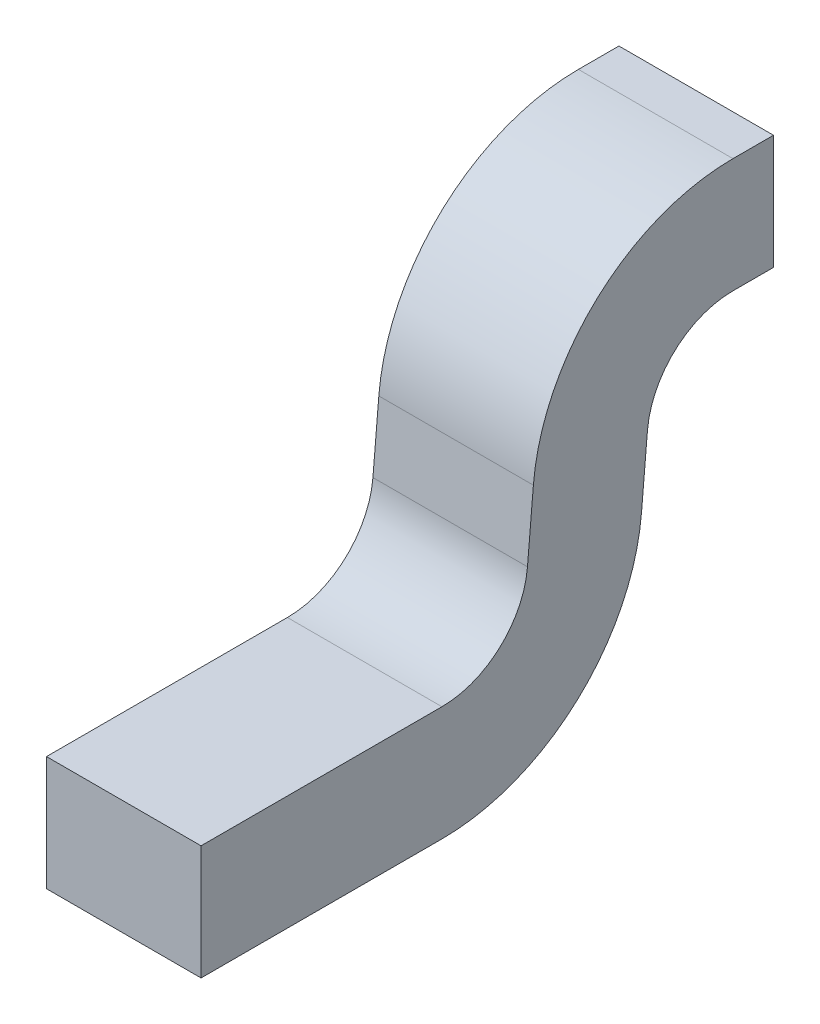
ISO-10303-21;
HEADER;
FILE_DESCRIPTION(('STEP AP214'),'2;1');
FILE_NAME('part.step','',(''),(''),'','','');
FILE_SCHEMA(('AUTOMOTIVE_DESIGN { 1 0 10303 214 1 1 1 1 }'));
ENDSEC;
DATA;
#1=APPLICATION_CONTEXT('core data for automotive mechanical design processes');
#2=APPLICATION_PROTOCOL_DEFINITION('international standard','automotive_design',2000,#1);
#3=PRODUCT_CONTEXT('',#1,'mechanical');
#4=PRODUCT('Part','Part','',(#3));
#5=PRODUCT_RELATED_PRODUCT_CATEGORY('part','',(#4));
#6=PRODUCT_DEFINITION_FORMATION('','',#4);
#7=PRODUCT_DEFINITION_CONTEXT('part definition',#1,'design');
#8=PRODUCT_DEFINITION('design','',#6,#7);
#9=PRODUCT_DEFINITION_SHAPE('','',#8);
#10=(LENGTH_UNIT() NAMED_UNIT(*) SI_UNIT(.MILLI.,.METRE.));
#11=(NAMED_UNIT(*) PLANE_ANGLE_UNIT() SI_UNIT($,.RADIAN.));
#12=(NAMED_UNIT(*) SI_UNIT($,.STERADIAN.) SOLID_ANGLE_UNIT());
#13=UNCERTAINTY_MEASURE_WITH_UNIT(LENGTH_MEASURE(1.E-05),#10,'distance_accuracy_value','');
#14=(GEOMETRIC_REPRESENTATION_CONTEXT(3) GLOBAL_UNCERTAINTY_ASSIGNED_CONTEXT((#13)) GLOBAL_UNIT_ASSIGNED_CONTEXT((#10,
#11,#12)) REPRESENTATION_CONTEXT('',''));
#15=CARTESIAN_POINT('',(0.,0.,0.));
#16=DIRECTION('',(0.,0.,1.));
#17=DIRECTION('',(1.,0.,0.));
#18=AXIS2_PLACEMENT_3D('',#15,#16,#17);
#19=CARTESIAN_POINT('',(-0.135,0.1,0.0707957308561916));
#20=DIRECTION('',(1.,0.,0.));
#21=DIRECTION('',(0.,1.,0.));
#22=AXIS2_PLACEMENT_3D('',#19,#20,#21);
#23=PLANE('',#22);
#24=CARTESIAN_POINT('',(-0.135,-0.25,0.0707957308561916));
#25=DIRECTION('',(1.,0.,0.));
#26=DIRECTION('',(0.,0.,-1.));
#27=AXIS2_PLACEMENT_3D('',#24,#25,#26);
#28=CIRCLE('',#27,0.15);
#29=CARTESIAN_POINT('',(-0.135,-0.1,0.0707957308561916));
#30=VERTEX_POINT('',#29);
#31=CARTESIAN_POINT('',(-0.135,-0.237005557545274,0.220231819085544));
#32=VERTEX_POINT('',#31);
#33=EDGE_CURVE('E19',#30,#32,#28,.T.);
#34=ORIENTED_EDGE('',*,*,#33,.T.);
#35=DIRECTION('',(0.,0.996240588195683,-0.0866296163648428));
#36=VECTOR('',#35,1.);
#37=CARTESIAN_POINT('',(-0.135,-0.237005557545274,0.220231819085544));
#38=LINE('',#37,#36);
#39=CARTESIAN_POINT('',(-0.135,-0.355320365727695,0.23052006327532));
#40=VERTEX_POINT('',#39);
#41=EDGE_CURVE('E149',#40,#32,#38,.T.);
#42=ORIENTED_EDGE('',*,*,#41,.F.);
#43=CARTESIAN_POINT('',(-0.135,-0.325,0.579204269143809));
#44=DIRECTION('',(-1.,0.,0.));
#45=DIRECTION('',(0.,0.,1.));
#46=AXIS2_PLACEMENT_3D('',#43,#44,#45);
#47=CIRCLE('',#46,0.35);
#48=CARTESIAN_POINT('',(-0.135,-0.675,0.579204269143809));
#49=VERTEX_POINT('',#48);
#50=EDGE_CURVE('E173',#49,#40,#47,.F.);
#51=ORIENTED_EDGE('',*,*,#50,.F.);
#52=DIRECTION('',(0.,0.,-1.));
#53=VECTOR('',#52,1.);
#54=CARTESIAN_POINT('',(-0.135,-0.675,0.579204269143809));
#55=LINE('',#54,#53);
#56=CARTESIAN_POINT('',(-0.135,-0.675,1.));
#57=VERTEX_POINT('',#56);
#58=EDGE_CURVE('E144',#57,#49,#55,.T.);
#59=ORIENTED_EDGE('',*,*,#58,.F.);
#60=DIRECTION('',(0.,-1.,0.));
#61=VECTOR('',#60,1.);
#62=CARTESIAN_POINT('',(-0.135,-0.675,1.));
#63=LINE('',#62,#61);
#64=CARTESIAN_POINT('',(-0.135,-0.475,1.));
#65=VERTEX_POINT('',#64);
#66=EDGE_CURVE('E137',#65,#57,#63,.T.);
#67=ORIENTED_EDGE('',*,*,#66,.F.);
#68=DIRECTION('',(0.,0.,1.));
#69=VECTOR('',#68,1.);
#70=CARTESIAN_POINT('',(-0.135,-0.475,0.579204269143809));
#71=LINE('',#70,#69);
#72=CARTESIAN_POINT('',(-0.135,-0.475,0.579204269143809));
#73=VERTEX_POINT('',#72);
#74=EDGE_CURVE('E130',#73,#65,#71,.T.);
#75=ORIENTED_EDGE('',*,*,#74,.F.);
#76=CARTESIAN_POINT('',(-0.135,-0.325,0.579204269143809));
#77=DIRECTION('',(-1.,0.,0.));
#78=DIRECTION('',(0.,0.,1.));
#79=AXIS2_PLACEMENT_3D('',#76,#77,#78);
#80=CIRCLE('',#79,0.15);
#81=CARTESIAN_POINT('',(-0.135,-0.337994442454726,0.429768180914457));
#82=VERTEX_POINT('',#81);
#83=EDGE_CURVE('E172',#73,#82,#80,.F.);
#84=ORIENTED_EDGE('',*,*,#83,.T.);
#85=DIRECTION('',(0.,-0.996240588195683,0.0866296163648428));
#86=VECTOR('',#85,1.);
#87=CARTESIAN_POINT('',(-0.135,-0.219679634272305,0.419479936724681));
#88=LINE('',#87,#86);
#89=CARTESIAN_POINT('',(-0.135,-0.219679634272305,0.419479936724681));
#90=VERTEX_POINT('',#89);
#91=EDGE_CURVE('E125',#90,#82,#88,.T.);
#92=ORIENTED_EDGE('',*,*,#91,.F.);
#93=CARTESIAN_POINT('',(-0.135,-0.25,0.0707957308561916));
#94=DIRECTION('',(1.,0.,0.));
#95=DIRECTION('',(0.,0.,-1.));
#96=AXIS2_PLACEMENT_3D('',#93,#94,#95);
#97=CIRCLE('',#96,0.35);
#98=CARTESIAN_POINT('',(-0.135,0.1,0.0707957308561916));
#99=VERTEX_POINT('',#98);
#100=EDGE_CURVE('E109',#99,#90,#97,.T.);
#101=ORIENTED_EDGE('',*,*,#100,.F.);
#102=DIRECTION('',(0.,0.,-1.));
#103=VECTOR('',#102,1.);
#104=CARTESIAN_POINT('',(-0.135,0.1,0.0707957308561916));
#105=LINE('',#104,#103);
#106=CARTESIAN_POINT('',(-0.135,0.1,0.));
#107=VERTEX_POINT('',#106);
#108=EDGE_CURVE('E108',#99,#107,#105,.T.);
#109=ORIENTED_EDGE('',*,*,#108,.T.);
#110=DIRECTION('',(0.,1.,0.));
#111=VECTOR('',#110,1.);
#112=CARTESIAN_POINT('',(-0.135,-0.1,0.));
#113=LINE('',#112,#111);
#114=CARTESIAN_POINT('',(-0.135,-0.1,0.));
#115=VERTEX_POINT('',#114);
#116=EDGE_CURVE('E94',#107,#115,#113,.F.);
#117=ORIENTED_EDGE('',*,*,#116,.T.);
#118=DIRECTION('',(0.,0.,1.));
#119=VECTOR('',#118,1.);
#120=CARTESIAN_POINT('',(-0.135,-0.1,0.0707957308561916));
#121=LINE('',#120,#119);
#122=EDGE_CURVE('E88',#115,#30,#121,.T.);
#123=ORIENTED_EDGE('',*,*,#122,.T.);
#124=EDGE_LOOP('',(#34,#42,#51,#59,#67,#75,#84,#92,#101,#109,#117,#123));
#125=FACE_BOUND('',#124,.T.);
#126=ADVANCED_FACE('F16',(#125),#23,.F.);
#127=CARTESIAN_POINT('',(0.135,-0.1,0.));
#128=DIRECTION('',(0.,0.,1.));
#129=DIRECTION('',(1.,0.,0.));
#130=AXIS2_PLACEMENT_3D('',#127,#128,#129);
#131=PLANE('',#130);
#132=ORIENTED_EDGE('',*,*,#116,.F.);
#133=DIRECTION('',(1.,0.,0.));
#134=VECTOR('',#133,1.);
#135=CARTESIAN_POINT('',(-0.135,0.1,0.));
#136=LINE('',#135,#134);
#137=CARTESIAN_POINT('',(0.135,0.1,0.));
#138=VERTEX_POINT('',#137);
#139=EDGE_CURVE('E103',#107,#138,#136,.T.);
#140=ORIENTED_EDGE('',*,*,#139,.T.);
#141=DIRECTION('',(0.,1.,0.));
#142=VECTOR('',#141,1.);
#143=CARTESIAN_POINT('',(0.135,0.1,0.));
#144=LINE('',#143,#142);
#145=CARTESIAN_POINT('',(0.135,-0.1,0.));
#146=VERTEX_POINT('',#145);
#147=EDGE_CURVE('E112',#138,#146,#144,.F.);
#148=ORIENTED_EDGE('',*,*,#147,.T.);
#149=DIRECTION('',(1.,0.,0.));
#150=VECTOR('',#149,1.);
#151=CARTESIAN_POINT('',(-0.135,-0.1,0.));
#152=LINE('',#151,#150);
#153=EDGE_CURVE('E105',#146,#115,#152,.F.);
#154=ORIENTED_EDGE('',*,*,#153,.T.);
#155=EDGE_LOOP('',(#132,#140,#148,#154));
#156=FACE_BOUND('',#155,.T.);
#157=ADVANCED_FACE('F101',(#156),#131,.F.);
#158=CARTESIAN_POINT('',(-0.135,-0.1,0.0707957308561916));
#159=DIRECTION('',(0.,1.,0.));
#160=DIRECTION('',(0.,0.,1.));
#161=AXIS2_PLACEMENT_3D('',#158,#159,#160);
#162=PLANE('',#161);
#163=DIRECTION('',(1.,0.,0.));
#164=VECTOR('',#163,1.);
#165=CARTESIAN_POINT('',(0.,-0.1,0.0707957308561916));
#166=LINE('',#165,#164);
#167=CARTESIAN_POINT('',(0.135,-0.1,0.0707957308561916));
#168=VERTEX_POINT('',#167);
#169=EDGE_CURVE('E153',#168,#30,#166,.F.);
#170=ORIENTED_EDGE('',*,*,#169,.T.);
#171=ORIENTED_EDGE('',*,*,#122,.F.);
#172=ORIENTED_EDGE('',*,*,#153,.F.);
#173=DIRECTION('',(0.,0.,1.));
#174=VECTOR('',#173,1.);
#175=CARTESIAN_POINT('',(0.135,-0.1,0.0707957308561916));
#176=LINE('',#175,#174);
#177=EDGE_CURVE('E114',#146,#168,#176,.T.);
#178=ORIENTED_EDGE('',*,*,#177,.T.);
#179=EDGE_LOOP('',(#170,#171,#172,#178));
#180=FACE_BOUND('',#179,.T.);
#181=ADVANCED_FACE('F199',(#180),#162,.F.);
#182=CARTESIAN_POINT('',(0.,-0.25,0.0707957308561916));
#183=DIRECTION('',(1.,0.,0.));
#184=DIRECTION('',(0.,0.,-1.));
#185=AXIS2_PLACEMENT_3D('',#182,#183,#184);
#186=CYLINDRICAL_SURFACE('',#185,0.15);
#187=DIRECTION('',(1.,0.,0.));
#188=VECTOR('',#187,1.);
#189=CARTESIAN_POINT('',(-0.135,-0.237005557545274,0.220231819085544));
#190=LINE('',#189,#188);
#191=CARTESIAN_POINT('',(0.135,-0.237005557545274,0.220231819085544));
#192=VERTEX_POINT('',#191);
#193=EDGE_CURVE('E151',#32,#192,#190,.T.);
#194=ORIENTED_EDGE('',*,*,#193,.F.);
#195=ORIENTED_EDGE('',*,*,#33,.F.);
#196=ORIENTED_EDGE('',*,*,#169,.F.);
#197=CARTESIAN_POINT('',(0.135,-0.25,0.0707957308561916));
#198=DIRECTION('',(1.,0.,0.));
#199=DIRECTION('',(0.,0.,-1.));
#200=AXIS2_PLACEMENT_3D('',#197,#198,#199);
#201=CIRCLE('',#200,0.15);
#202=EDGE_CURVE('E168',#168,#192,#201,.T.);
#203=ORIENTED_EDGE('',*,*,#202,.T.);
#204=EDGE_LOOP('',(#194,#195,#196,#203));
#205=FACE_BOUND('',#204,.T.);
#206=ADVANCED_FACE('F191',(#205),#186,.F.);
#207=CARTESIAN_POINT('',(-0.135,-0.237005557545274,0.220231819085544));
#208=DIRECTION('',(0.,-0.0866296163648428,-0.996240588195683));
#209=DIRECTION('',(0.,0.996240588195683,-0.0866296163648428));
#210=AXIS2_PLACEMENT_3D('',#207,#208,#209);
#211=PLANE('',#210);
#212=ORIENTED_EDGE('',*,*,#193,.T.);
#213=DIRECTION('',(0.,-0.996240588195683,0.0866296163648426));
#214=VECTOR('',#213,1.);
#215=CARTESIAN_POINT('',(0.135,-0.237005557545274,0.220231819085544));
#216=LINE('',#215,#214);
#217=CARTESIAN_POINT('',(0.135,-0.355320365727695,0.23052006327532));
#218=VERTEX_POINT('',#217);
#219=EDGE_CURVE('E167',#192,#218,#216,.T.);
#220=ORIENTED_EDGE('',*,*,#219,.T.);
#221=DIRECTION('',(-1.,0.,0.));
#222=VECTOR('',#221,1.);
#223=CARTESIAN_POINT('',(0.,-0.355320365727695,0.23052006327532));
#224=LINE('',#223,#222);
#225=EDGE_CURVE('E146',#40,#218,#224,.F.);
#226=ORIENTED_EDGE('',*,*,#225,.F.);
#227=ORIENTED_EDGE('',*,*,#41,.T.);
#228=EDGE_LOOP('',(#212,#220,#226,#227));
#229=FACE_BOUND('',#228,.T.);
#230=ADVANCED_FACE('F236',(#229),#211,.T.);
#231=CARTESIAN_POINT('',(0.,-0.325,0.579204269143809));
#232=DIRECTION('',(-1.,0.,0.));
#233=DIRECTION('',(0.,0.,1.));
#234=AXIS2_PLACEMENT_3D('',#231,#232,#233);
#235=CYLINDRICAL_SURFACE('',#234,0.35);
#236=ORIENTED_EDGE('',*,*,#225,.T.);
#237=CARTESIAN_POINT('',(0.135,-0.325,0.579204269143809));
#238=DIRECTION('',(-1.,0.,0.));
#239=DIRECTION('',(0.,0.,1.));
#240=AXIS2_PLACEMENT_3D('',#237,#238,#239);
#241=CIRCLE('',#240,0.35);
#242=CARTESIAN_POINT('',(0.135,-0.675,0.579204269143809));
#243=VERTEX_POINT('',#242);
#244=EDGE_CURVE('E163',#218,#243,#241,.T.);
#245=ORIENTED_EDGE('',*,*,#244,.T.);
#246=DIRECTION('',(1.,0.,0.));
#247=VECTOR('',#246,1.);
#248=CARTESIAN_POINT('',(-0.135,-0.675,0.579204269143809));
#249=LINE('',#248,#247);
#250=EDGE_CURVE('E141',#49,#243,#249,.T.);
#251=ORIENTED_EDGE('',*,*,#250,.F.);
#252=ORIENTED_EDGE('',*,*,#50,.T.);
#253=EDGE_LOOP('',(#236,#245,#251,#252));
#254=FACE_BOUND('',#253,.T.);
#255=ADVANCED_FACE('F235',(#254),#235,.T.);
#256=CARTESIAN_POINT('',(-0.135,-0.675,0.579204269143809));
#257=DIRECTION('',(0.,-1.,0.));
#258=DIRECTION('',(0.,0.,-1.));
#259=AXIS2_PLACEMENT_3D('',#256,#257,#258);
#260=PLANE('',#259);
#261=ORIENTED_EDGE('',*,*,#250,.T.);
#262=DIRECTION('',(0.,0.,1.));
#263=VECTOR('',#262,1.);
#264=CARTESIAN_POINT('',(0.135,-0.675,0.0707957308561916));
#265=LINE('',#264,#263);
#266=CARTESIAN_POINT('',(0.135,-0.675,1.));
#267=VERTEX_POINT('',#266);
#268=EDGE_CURVE('E166',#243,#267,#265,.T.);
#269=ORIENTED_EDGE('',*,*,#268,.T.);
#270=DIRECTION('',(1.,0.,0.));
#271=VECTOR('',#270,1.);
#272=CARTESIAN_POINT('',(0.135,-0.675,1.));
#273=LINE('',#272,#271);
#274=EDGE_CURVE('E140',#57,#267,#273,.T.);
#275=ORIENTED_EDGE('',*,*,#274,.F.);
#276=ORIENTED_EDGE('',*,*,#58,.T.);
#277=EDGE_LOOP('',(#261,#269,#275,#276));
#278=FACE_BOUND('',#277,.T.);
#279=ADVANCED_FACE('F229',(#278),#260,.T.);
#280=CARTESIAN_POINT('',(0.135,-0.675,1.));
#281=DIRECTION('',(0.,0.,1.));
#282=DIRECTION('',(0.,-1.,0.));
#283=AXIS2_PLACEMENT_3D('',#280,#281,#282);
#284=PLANE('',#283);
#285=DIRECTION('',(0.,1.,0.));
#286=VECTOR('',#285,1.);
#287=CARTESIAN_POINT('',(0.135,0.1,1.));
#288=LINE('',#287,#286);
#289=CARTESIAN_POINT('',(0.135,-0.475,1.));
#290=VERTEX_POINT('',#289);
#291=EDGE_CURVE('E218',#267,#290,#288,.T.);
#292=ORIENTED_EDGE('',*,*,#291,.T.);
#293=DIRECTION('',(1.,0.,0.));
#294=VECTOR('',#293,1.);
#295=CARTESIAN_POINT('',(-0.135,-0.475,1.));
#296=LINE('',#295,#294);
#297=EDGE_CURVE('E134',#65,#290,#296,.T.);
#298=ORIENTED_EDGE('',*,*,#297,.F.);
#299=ORIENTED_EDGE('',*,*,#66,.T.);
#300=ORIENTED_EDGE('',*,*,#274,.T.);
#301=EDGE_LOOP('',(#292,#298,#299,#300));
#302=FACE_BOUND('',#301,.T.);
#303=ADVANCED_FACE('F268',(#302),#284,.T.);
#304=CARTESIAN_POINT('',(-0.135,-0.475,0.579204269143809));
#305=DIRECTION('',(0.,1.,0.));
#306=DIRECTION('',(0.,0.,1.));
#307=AXIS2_PLACEMENT_3D('',#304,#305,#306);
#308=PLANE('',#307);
#309=DIRECTION('',(-1.,0.,0.));
#310=VECTOR('',#309,1.);
#311=CARTESIAN_POINT('',(0.,-0.475,0.579204269143809));
#312=LINE('',#311,#310);
#313=CARTESIAN_POINT('',(0.135,-0.475,0.579204269143809));
#314=VERTEX_POINT('',#313);
#315=EDGE_CURVE('E133',#314,#73,#312,.T.);
#316=ORIENTED_EDGE('',*,*,#315,.T.);
#317=ORIENTED_EDGE('',*,*,#74,.T.);
#318=ORIENTED_EDGE('',*,*,#297,.T.);
#319=DIRECTION('',(0.,0.,1.));
#320=VECTOR('',#319,1.);
#321=CARTESIAN_POINT('',(0.135,-0.475,0.0707957308561916));
#322=LINE('',#321,#320);
#323=EDGE_CURVE('E162',#290,#314,#322,.F.);
#324=ORIENTED_EDGE('',*,*,#323,.T.);
#325=EDGE_LOOP('',(#316,#317,#318,#324));
#326=FACE_BOUND('',#325,.T.);
#327=ADVANCED_FACE('F264',(#326),#308,.T.);
#328=CARTESIAN_POINT('',(0.,-0.325,0.579204269143809));
#329=DIRECTION('',(-1.,0.,0.));
#330=DIRECTION('',(0.,0.,1.));
#331=AXIS2_PLACEMENT_3D('',#328,#329,#330);
#332=CYLINDRICAL_SURFACE('',#331,0.15);
#333=ORIENTED_EDGE('',*,*,#315,.F.);
#334=CARTESIAN_POINT('',(0.135,-0.325,0.579204269143809));
#335=DIRECTION('',(-1.,0.,0.));
#336=DIRECTION('',(0.,0.,1.));
#337=AXIS2_PLACEMENT_3D('',#334,#335,#336);
#338=CIRCLE('',#337,0.15);
#339=CARTESIAN_POINT('',(0.135,-0.337994442454726,0.429768180914457));
#340=VERTEX_POINT('',#339);
#341=EDGE_CURVE('E159',#314,#340,#338,.F.);
#342=ORIENTED_EDGE('',*,*,#341,.T.);
#343=DIRECTION('',(1.,0.,0.));
#344=VECTOR('',#343,1.);
#345=CARTESIAN_POINT('',(-0.135,-0.337994442454726,0.429768180914457));
#346=LINE('',#345,#344);
#347=EDGE_CURVE('E129',#82,#340,#346,.T.);
#348=ORIENTED_EDGE('',*,*,#347,.F.);
#349=ORIENTED_EDGE('',*,*,#83,.F.);
#350=EDGE_LOOP('',(#333,#342,#348,#349));
#351=FACE_BOUND('',#350,.T.);
#352=ADVANCED_FACE('F260',(#351),#332,.F.);
#353=CARTESIAN_POINT('',(-0.135,-0.219679634272305,0.419479936724681));
#354=DIRECTION('',(0.,0.0866296163648428,0.996240588195683));
#355=DIRECTION('',(0.,-0.996240588195683,0.0866296163648428));
#356=AXIS2_PLACEMENT_3D('',#353,#354,#355);
#357=PLANE('',#356);
#358=DIRECTION('',(1.,0.,0.));
#359=VECTOR('',#358,1.);
#360=CARTESIAN_POINT('',(0.,-0.219679634272305,0.419479936724681));
#361=LINE('',#360,#359);
#362=CARTESIAN_POINT('',(0.135,-0.219679634272305,0.419479936724681));
#363=VERTEX_POINT('',#362);
#364=EDGE_CURVE('E128',#90,#363,#361,.T.);
#365=ORIENTED_EDGE('',*,*,#364,.F.);
#366=ORIENTED_EDGE('',*,*,#91,.T.);
#367=ORIENTED_EDGE('',*,*,#347,.T.);
#368=DIRECTION('',(0.,0.996240588195683,-0.0866296163648413));
#369=VECTOR('',#368,1.);
#370=CARTESIAN_POINT('',(0.135,-0.337994442454726,0.429768180914456));
#371=LINE('',#370,#369);
#372=EDGE_CURVE('E158',#340,#363,#371,.T.);
#373=ORIENTED_EDGE('',*,*,#372,.T.);
#374=EDGE_LOOP('',(#365,#366,#367,#373));
#375=FACE_BOUND('',#374,.T.);
#376=ADVANCED_FACE('F256',(#375),#357,.T.);
#377=CARTESIAN_POINT('',(0.,-0.25,0.0707957308561916));
#378=DIRECTION('',(1.,0.,0.));
#379=DIRECTION('',(0.,0.,-1.));
#380=AXIS2_PLACEMENT_3D('',#377,#378,#379);
#381=CYLINDRICAL_SURFACE('',#380,0.35);
#382=DIRECTION('',(1.,0.,0.));
#383=VECTOR('',#382,1.);
#384=CARTESIAN_POINT('',(-0.135,0.1,0.0707957308561916));
#385=LINE('',#384,#383);
#386=CARTESIAN_POINT('',(0.135,0.1,0.0707957308561916));
#387=VERTEX_POINT('',#386);
#388=EDGE_CURVE('E33',#387,#99,#385,.F.);
#389=ORIENTED_EDGE('',*,*,#388,.T.);
#390=ORIENTED_EDGE('',*,*,#100,.T.);
#391=ORIENTED_EDGE('',*,*,#364,.T.);
#392=CARTESIAN_POINT('',(0.135,-0.25,0.0707957308561916));
#393=DIRECTION('',(1.,0.,0.));
#394=DIRECTION('',(0.,0.,-1.));
#395=AXIS2_PLACEMENT_3D('',#392,#393,#394);
#396=CIRCLE('',#395,0.35);
#397=EDGE_CURVE('E25',#363,#387,#396,.F.);
#398=ORIENTED_EDGE('',*,*,#397,.T.);
#399=EDGE_LOOP('',(#389,#390,#391,#398));
#400=FACE_BOUND('',#399,.T.);
#401=ADVANCED_FACE('F251',(#400),#381,.T.);
#402=CARTESIAN_POINT('',(-0.135,0.1,0.0707957308561916));
#403=DIRECTION('',(0.,-1.,0.));
#404=DIRECTION('',(0.,0.,-1.));
#405=AXIS2_PLACEMENT_3D('',#402,#403,#404);
#406=PLANE('',#405);
#407=ORIENTED_EDGE('',*,*,#388,.F.);
#408=DIRECTION('',(0.,0.,1.));
#409=VECTOR('',#408,1.);
#410=CARTESIAN_POINT('',(0.135,0.1,0.0707957308561916));
#411=LINE('',#410,#409);
#412=EDGE_CURVE('E11',#387,#138,#411,.F.);
#413=ORIENTED_EDGE('',*,*,#412,.T.);
#414=ORIENTED_EDGE('',*,*,#139,.F.);
#415=ORIENTED_EDGE('',*,*,#108,.F.);
#416=EDGE_LOOP('',(#407,#413,#414,#415));
#417=FACE_BOUND('',#416,.T.);
#418=ADVANCED_FACE('F107',(#417),#406,.F.);
#419=CARTESIAN_POINT('',(0.135,0.1,0.0707957308561916));
#420=DIRECTION('',(-1.,0.,0.));
#421=DIRECTION('',(0.,0.,1.));
#422=AXIS2_PLACEMENT_3D('',#419,#420,#421);
#423=PLANE('',#422);
#424=ORIENTED_EDGE('',*,*,#397,.F.);
#425=ORIENTED_EDGE('',*,*,#372,.F.);
#426=ORIENTED_EDGE('',*,*,#341,.F.);
#427=ORIENTED_EDGE('',*,*,#323,.F.);
#428=ORIENTED_EDGE('',*,*,#291,.F.);
#429=ORIENTED_EDGE('',*,*,#268,.F.);
#430=ORIENTED_EDGE('',*,*,#244,.F.);
#431=ORIENTED_EDGE('',*,*,#219,.F.);
#432=ORIENTED_EDGE('',*,*,#202,.F.);
#433=ORIENTED_EDGE('',*,*,#177,.F.);
#434=ORIENTED_EDGE('',*,*,#147,.F.);
#435=ORIENTED_EDGE('',*,*,#412,.F.);
#436=EDGE_LOOP('',(#424,#425,#426,#427,#428,#429,#430,#431,#432,#433,#434,#435));
#437=FACE_BOUND('',#436,.T.);
#438=ADVANCED_FACE('F196',(#437),#423,.F.);
#439=CLOSED_SHELL('',(#126,#157,#181,#206,#230,#255,#279,#303,#327,#352,#376,#401,#418,#438));
#440=MANIFOLD_SOLID_BREP('B1',#439);
#441=ADVANCED_BREP_SHAPE_REPRESENTATION('',(#18,#440),#14);
#442=SHAPE_DEFINITION_REPRESENTATION(#9,#441);
ENDSEC;
END-ISO-10303-21;
